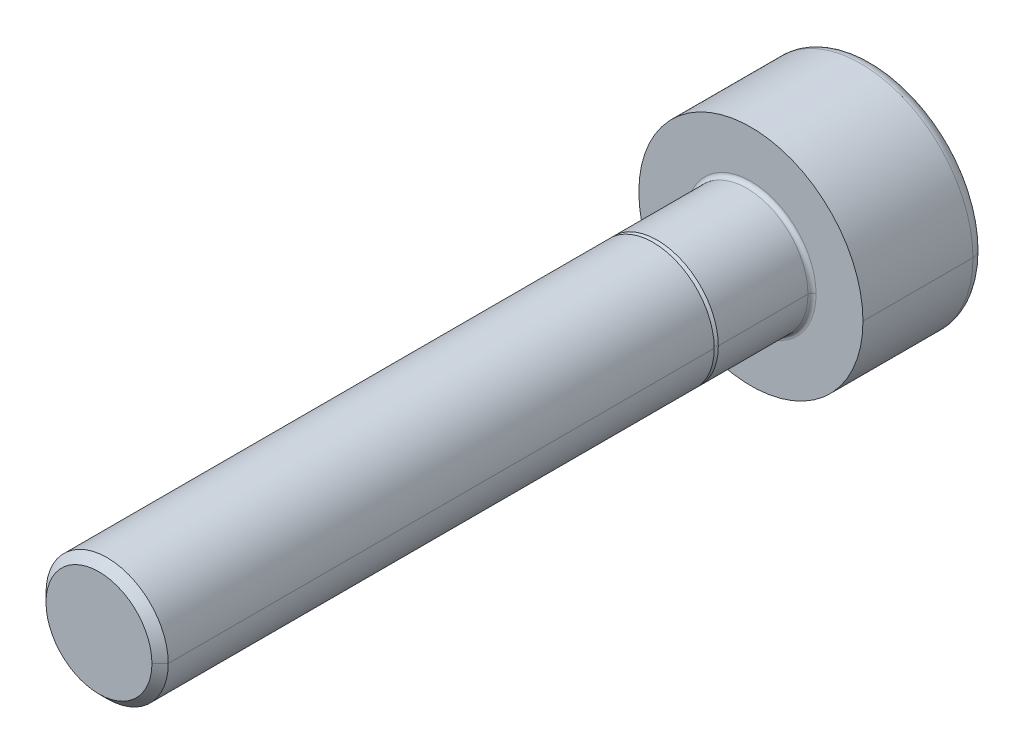
ISO-10303-21;
HEADER;
FILE_DESCRIPTION(('STEP AP214'),'2;1');
FILE_NAME('part.step','',(''),(''),'','','');
FILE_SCHEMA(('AUTOMOTIVE_DESIGN { 1 0 10303 214 1 1 1 1 }'));
ENDSEC;
DATA;
#1=APPLICATION_CONTEXT('core data for automotive mechanical design processes');
#2=APPLICATION_PROTOCOL_DEFINITION('international standard','automotive_design',2000,#1);
#3=PRODUCT_CONTEXT('',#1,'mechanical');
#4=PRODUCT('Part','Part','',(#3));
#5=PRODUCT_RELATED_PRODUCT_CATEGORY('part','',(#4));
#6=PRODUCT_DEFINITION_FORMATION('','',#4);
#7=PRODUCT_DEFINITION_CONTEXT('part definition',#1,'design');
#8=PRODUCT_DEFINITION('design','',#6,#7);
#9=PRODUCT_DEFINITION_SHAPE('','',#8);
#10=(LENGTH_UNIT() NAMED_UNIT(*) SI_UNIT(.MILLI.,.METRE.));
#11=(NAMED_UNIT(*) PLANE_ANGLE_UNIT() SI_UNIT($,.RADIAN.));
#12=(NAMED_UNIT(*) SI_UNIT($,.STERADIAN.) SOLID_ANGLE_UNIT());
#13=UNCERTAINTY_MEASURE_WITH_UNIT(LENGTH_MEASURE(1.E-05),#10,'distance_accuracy_value','');
#14=(GEOMETRIC_REPRESENTATION_CONTEXT(3) GLOBAL_UNCERTAINTY_ASSIGNED_CONTEXT((#13)) GLOBAL_UNIT_ASSIGNED_CONTEXT((#10,
#11,#12)) REPRESENTATION_CONTEXT('',''));
#15=CARTESIAN_POINT('',(0.,0.,0.));
#16=DIRECTION('',(0.,0.,1.));
#17=DIRECTION('',(1.,0.,0.));
#18=AXIS2_PLACEMENT_3D('',#15,#16,#17);
#19=CARTESIAN_POINT('',(0.,0.,-2.7));
#20=DIRECTION('',(0.,0.,1.));
#21=DIRECTION('',(1.,0.,0.));
#22=AXIS2_PLACEMENT_3D('',#19,#20,#21);
#23=TOROIDAL_SURFACE('',#22,2.45,0.3);
#24=CARTESIAN_POINT('',(-2.45,0.,-2.7));
#25=DIRECTION('',(0.,1.,0.));
#26=DIRECTION('',(-1.,0.,0.));
#27=AXIS2_PLACEMENT_3D('',#24,#25,#26);
#28=CIRCLE('',#27,0.3);
#29=CARTESIAN_POINT('',(-2.45,0.,-3.));
#30=VERTEX_POINT('',#29);
#31=CARTESIAN_POINT('',(-2.75,0.,-2.7));
#32=VERTEX_POINT('',#31);
#33=EDGE_CURVE('E331',#30,#32,#28,.T.);
#34=ORIENTED_EDGE('',*,*,#33,.F.);
#35=CARTESIAN_POINT('',(0.,0.,-3.));
#36=DIRECTION('',(0.,0.,-1.));
#37=DIRECTION('',(1.,0.,0.));
#38=AXIS2_PLACEMENT_3D('',#35,#36,#37);
#39=CIRCLE('',#38,2.45);
#40=CARTESIAN_POINT('',(2.45,0.,-3.));
#41=VERTEX_POINT('',#40);
#42=EDGE_CURVE('E216',#41,#30,#39,.T.);
#43=ORIENTED_EDGE('',*,*,#42,.F.);
#44=CARTESIAN_POINT('',(2.45,0.,-2.7));
#45=DIRECTION('',(0.,-1.,0.));
#46=DIRECTION('',(0.,0.,-1.));
#47=AXIS2_PLACEMENT_3D('',#44,#45,#46);
#48=CIRCLE('',#47,0.3);
#49=CARTESIAN_POINT('',(2.75,0.,-2.7));
#50=VERTEX_POINT('',#49);
#51=EDGE_CURVE('E339',#41,#50,#48,.T.);
#52=ORIENTED_EDGE('',*,*,#51,.T.);
#53=CARTESIAN_POINT('',(0.,0.,-2.7));
#54=DIRECTION('',(0.,0.,1.));
#55=DIRECTION('',(1.,0.,0.));
#56=AXIS2_PLACEMENT_3D('',#53,#54,#55);
#57=CIRCLE('',#56,2.75);
#58=EDGE_CURVE('E211',#32,#50,#57,.T.);
#59=ORIENTED_EDGE('',*,*,#58,.F.);
#60=EDGE_LOOP('',(#34,#43,#52,#59));
#61=FACE_BOUND('',#60,.T.);
#62=ADVANCED_FACE('F17',(#61),#23,.T.);
#63=CARTESIAN_POINT('',(0.,0.,0.1));
#64=DIRECTION('',(0.,0.,1.));
#65=DIRECTION('',(1.,0.,0.));
#66=AXIS2_PLACEMENT_3D('',#63,#64,#65);
#67=TOROIDAL_SURFACE('',#66,1.6,0.1);
#68=CARTESIAN_POINT('',(-1.6,0.,0.1));
#69=DIRECTION('',(0.,1.,0.));
#70=DIRECTION('',(-1.,0.,0.));
#71=AXIS2_PLACEMENT_3D('',#68,#69,#70);
#72=CIRCLE('',#71,0.1);
#73=CARTESIAN_POINT('',(-1.5,0.,0.1));
#74=VERTEX_POINT('',#73);
#75=CARTESIAN_POINT('',(-1.6,0.,0.));
#76=VERTEX_POINT('',#75);
#77=EDGE_CURVE('E362',#74,#76,#72,.T.);
#78=ORIENTED_EDGE('',*,*,#77,.F.);
#79=CARTESIAN_POINT('',(0.,0.,0.1));
#80=DIRECTION('',(0.,0.,1.));
#81=DIRECTION('',(1.,0.,0.));
#82=AXIS2_PLACEMENT_3D('',#79,#80,#81);
#83=CIRCLE('',#82,1.5);
#84=CARTESIAN_POINT('',(1.5,0.,0.1));
#85=VERTEX_POINT('',#84);
#86=EDGE_CURVE('E176',#85,#74,#83,.T.);
#87=ORIENTED_EDGE('',*,*,#86,.F.);
#88=CARTESIAN_POINT('',(1.6,0.,0.1));
#89=DIRECTION('',(0.,-1.,0.));
#90=DIRECTION('',(0.,0.,-1.));
#91=AXIS2_PLACEMENT_3D('',#88,#89,#90);
#92=CIRCLE('',#91,0.1);
#93=CARTESIAN_POINT('',(1.6,0.,0.));
#94=VERTEX_POINT('',#93);
#95=EDGE_CURVE('E367',#85,#94,#92,.T.);
#96=ORIENTED_EDGE('',*,*,#95,.T.);
#97=CARTESIAN_POINT('',(0.,0.,0.));
#98=DIRECTION('',(0.,0.,-1.));
#99=DIRECTION('',(1.,0.,0.));
#100=AXIS2_PLACEMENT_3D('',#97,#98,#99);
#101=CIRCLE('',#100,1.6);
#102=EDGE_CURVE('E202',#76,#94,#101,.T.);
#103=ORIENTED_EDGE('',*,*,#102,.F.);
#104=EDGE_LOOP('',(#78,#87,#96,#103));
#105=FACE_BOUND('',#104,.T.);
#106=ADVANCED_FACE('F519',(#105),#67,.F.);
#107=CARTESIAN_POINT('',(0.,0.,16.));
#108=DIRECTION('',(0.,0.,-1.));
#109=DIRECTION('',(-1.,0.,0.));
#110=AXIS2_PLACEMENT_3D('',#107,#108,#109);
#111=CONICAL_SURFACE('',#110,1.3,0.785398163397442);
#112=DIRECTION('',(0.707106781186543,0.,-0.707106781186553));
#113=VECTOR('',#112,1.);
#114=CARTESIAN_POINT('',(1.3,0.,16.));
#115=LINE('',#114,#113);
#116=CARTESIAN_POINT('',(1.3,0.,16.));
#117=VERTEX_POINT('',#116);
#118=CARTESIAN_POINT('',(1.5,0.,15.8));
#119=VERTEX_POINT('',#118);
#120=EDGE_CURVE('E156',#117,#119,#115,.T.);
#121=ORIENTED_EDGE('',*,*,#120,.F.);
#122=CARTESIAN_POINT('',(0.,0.,16.));
#123=DIRECTION('',(0.,0.,1.));
#124=DIRECTION('',(1.,0.,0.));
#125=AXIS2_PLACEMENT_3D('',#122,#123,#124);
#126=CIRCLE('',#125,1.3);
#127=CARTESIAN_POINT('',(-1.3,0.,16.));
#128=VERTEX_POINT('',#127);
#129=EDGE_CURVE('E11',#128,#117,#126,.T.);
#130=ORIENTED_EDGE('',*,*,#129,.F.);
#131=DIRECTION('',(-0.707106781186543,0.,-0.707106781186553));
#132=VECTOR('',#131,1.);
#133=CARTESIAN_POINT('',(-1.3,0.,16.));
#134=LINE('',#133,#132);
#135=CARTESIAN_POINT('',(-1.5,0.,15.8));
#136=VERTEX_POINT('',#135);
#137=EDGE_CURVE('E155',#128,#136,#134,.T.);
#138=ORIENTED_EDGE('',*,*,#137,.T.);
#139=CARTESIAN_POINT('',(0.,0.,15.8));
#140=DIRECTION('',(0.,0.,-1.));
#141=DIRECTION('',(1.,0.,0.));
#142=AXIS2_PLACEMENT_3D('',#139,#140,#141);
#143=CIRCLE('',#142,1.5);
#144=EDGE_CURVE('E167',#119,#136,#143,.T.);
#145=ORIENTED_EDGE('',*,*,#144,.F.);
#146=EDGE_LOOP('',(#121,#130,#138,#145));
#147=FACE_BOUND('',#146,.T.);
#148=ADVANCED_FACE('F396',(#147),#111,.T.);
#149=CARTESIAN_POINT('',(0.,0.,2.4));
#150=DIRECTION('',(0.,0.,1.));
#151=DIRECTION('',(1.,0.,0.));
#152=AXIS2_PLACEMENT_3D('',#149,#150,#151);
#153=PLANE('',#152);
#154=CARTESIAN_POINT('',(0.,0.,2.4));
#155=DIRECTION('',(0.,0.,1.));
#156=DIRECTION('',(1.,0.,0.));
#157=AXIS2_PLACEMENT_3D('',#154,#155,#156);
#158=CIRCLE('',#157,1.4);
#159=CARTESIAN_POINT('',(-1.4,0.,2.4));
#160=VERTEX_POINT('',#159);
#161=CARTESIAN_POINT('',(1.4,0.,2.4));
#162=VERTEX_POINT('',#161);
#163=EDGE_CURVE('E170',#160,#162,#158,.T.);
#164=ORIENTED_EDGE('',*,*,#163,.T.);
#165=CARTESIAN_POINT('',(0.,0.,2.4));
#166=DIRECTION('',(0.,0.,1.));
#167=DIRECTION('',(1.,0.,0.));
#168=AXIS2_PLACEMENT_3D('',#165,#166,#167);
#169=CIRCLE('',#168,1.4);
#170=EDGE_CURVE('E157',#162,#160,#169,.T.);
#171=ORIENTED_EDGE('',*,*,#170,.T.);
#172=EDGE_LOOP('',(#164,#171));
#173=FACE_BOUND('',#172,.T.);
#174=CARTESIAN_POINT('',(0.,0.,2.4));
#175=DIRECTION('',(0.,0.,1.));
#176=DIRECTION('',(1.,0.,0.));
#177=AXIS2_PLACEMENT_3D('',#174,#175,#176);
#178=CIRCLE('',#177,1.5);
#179=CARTESIAN_POINT('',(-1.5,0.,2.4));
#180=VERTEX_POINT('',#179);
#181=CARTESIAN_POINT('',(1.5,0.,2.4));
#182=VERTEX_POINT('',#181);
#183=EDGE_CURVE('E20',#180,#182,#178,.T.);
#184=ORIENTED_EDGE('',*,*,#183,.F.);
#185=CARTESIAN_POINT('',(0.,0.,2.4));
#186=DIRECTION('',(0.,0.,1.));
#187=DIRECTION('',(1.,0.,0.));
#188=AXIS2_PLACEMENT_3D('',#185,#186,#187);
#189=CIRCLE('',#188,1.5);
#190=EDGE_CURVE('E166',#182,#180,#189,.T.);
#191=ORIENTED_EDGE('',*,*,#190,.F.);
#192=EDGE_LOOP('',(#184,#191));
#193=FACE_BOUND('',#192,.T.);
#194=ADVANCED_FACE('F264',(#173,#193),#153,.F.);
#195=CARTESIAN_POINT('',(0.,0.,16.));
#196=DIRECTION('',(0.,0.,1.));
#197=DIRECTION('',(1.,0.,0.));
#198=AXIS2_PLACEMENT_3D('',#195,#196,#197);
#199=PLANE('',#198);
#200=ORIENTED_EDGE('',*,*,#129,.T.);
#201=CARTESIAN_POINT('',(0.,0.,16.));
#202=DIRECTION('',(0.,0.,1.));
#203=DIRECTION('',(1.,0.,0.));
#204=AXIS2_PLACEMENT_3D('',#201,#202,#203);
#205=CIRCLE('',#204,1.3);
#206=EDGE_CURVE('E353',#117,#128,#205,.T.);
#207=ORIENTED_EDGE('',*,*,#206,.T.);
#208=EDGE_LOOP('',(#200,#207));
#209=FACE_BOUND('',#208,.T.);
#210=ADVANCED_FACE('F389',(#209),#199,.T.);
#211=CARTESIAN_POINT('',(0.,0.,16.));
#212=DIRECTION('',(0.,0.,-1.));
#213=DIRECTION('',(-1.,0.,0.));
#214=AXIS2_PLACEMENT_3D('',#211,#212,#213);
#215=CYLINDRICAL_SURFACE('',#214,1.5);
#216=DIRECTION('',(0.,0.,-1.));
#217=VECTOR('',#216,1.);
#218=CARTESIAN_POINT('',(1.5,0.,16.));
#219=LINE('',#218,#217);
#220=EDGE_CURVE('E150',#119,#182,#219,.T.);
#221=ORIENTED_EDGE('',*,*,#220,.F.);
#222=ORIENTED_EDGE('',*,*,#144,.T.);
#223=DIRECTION('',(0.,0.,-1.));
#224=VECTOR('',#223,1.);
#225=CARTESIAN_POINT('',(-1.5,0.,16.));
#226=LINE('',#225,#224);
#227=EDGE_CURVE('E162',#136,#180,#226,.T.);
#228=ORIENTED_EDGE('',*,*,#227,.T.);
#229=ORIENTED_EDGE('',*,*,#183,.T.);
#230=EDGE_LOOP('',(#221,#222,#228,#229));
#231=FACE_BOUND('',#230,.T.);
#232=ADVANCED_FACE('F401',(#231),#215,.T.);
#233=CARTESIAN_POINT('',(0.,0.,2.4));
#234=DIRECTION('',(0.,0.,-1.));
#235=DIRECTION('',(-1.,0.,0.));
#236=AXIS2_PLACEMENT_3D('',#233,#234,#235);
#237=CONICAL_SURFACE('',#236,1.4,0.785398163397446);
#238=DIRECTION('',(0.707106781186546,0.,-0.707106781186549));
#239=VECTOR('',#238,1.);
#240=CARTESIAN_POINT('',(1.4,0.,2.4));
#241=LINE('',#240,#239);
#242=CARTESIAN_POINT('',(1.5,0.,2.3));
#243=VERTEX_POINT('',#242);
#244=EDGE_CURVE('E161',#162,#243,#241,.T.);
#245=ORIENTED_EDGE('',*,*,#244,.F.);
#246=ORIENTED_EDGE('',*,*,#163,.F.);
#247=DIRECTION('',(-0.707106781186546,0.,-0.707106781186549));
#248=VECTOR('',#247,1.);
#249=CARTESIAN_POINT('',(-1.4,0.,2.4));
#250=LINE('',#249,#248);
#251=CARTESIAN_POINT('',(-1.5,0.,2.3));
#252=VERTEX_POINT('',#251);
#253=EDGE_CURVE('E187',#160,#252,#250,.T.);
#254=ORIENTED_EDGE('',*,*,#253,.T.);
#255=CARTESIAN_POINT('',(0.,0.,2.3));
#256=DIRECTION('',(0.,0.,-1.));
#257=DIRECTION('',(1.,0.,0.));
#258=AXIS2_PLACEMENT_3D('',#255,#256,#257);
#259=CIRCLE('',#258,1.5);
#260=EDGE_CURVE('E253',#243,#252,#259,.T.);
#261=ORIENTED_EDGE('',*,*,#260,.F.);
#262=EDGE_LOOP('',(#245,#246,#254,#261));
#263=FACE_BOUND('',#262,.T.);
#264=ADVANCED_FACE('F269',(#263),#237,.T.);
#265=CARTESIAN_POINT('',(0.,0.,2.4));
#266=DIRECTION('',(0.,0.,-1.));
#267=DIRECTION('',(-1.,0.,0.));
#268=AXIS2_PLACEMENT_3D('',#265,#266,#267);
#269=CYLINDRICAL_SURFACE('',#268,1.5);
#270=DIRECTION('',(0.,0.,-1.));
#271=VECTOR('',#270,1.);
#272=CARTESIAN_POINT('',(1.5,0.,2.4));
#273=LINE('',#272,#271);
#274=EDGE_CURVE('E191',#243,#85,#273,.T.);
#275=ORIENTED_EDGE('',*,*,#274,.F.);
#276=ORIENTED_EDGE('',*,*,#260,.T.);
#277=DIRECTION('',(0.,0.,-1.));
#278=VECTOR('',#277,1.);
#279=CARTESIAN_POINT('',(-1.5,0.,2.4));
#280=LINE('',#279,#278);
#281=EDGE_CURVE('E171',#252,#74,#280,.T.);
#282=ORIENTED_EDGE('',*,*,#281,.T.);
#283=CARTESIAN_POINT('',(0.,0.,0.1));
#284=DIRECTION('',(0.,0.,1.));
#285=DIRECTION('',(1.,0.,0.));
#286=AXIS2_PLACEMENT_3D('',#283,#284,#285);
#287=CIRCLE('',#286,1.5);
#288=EDGE_CURVE('E358',#74,#85,#287,.T.);
#289=ORIENTED_EDGE('',*,*,#288,.T.);
#290=EDGE_LOOP('',(#275,#276,#282,#289));
#291=FACE_BOUND('',#290,.T.);
#292=ADVANCED_FACE('F612',(#291),#269,.T.);
#293=CARTESIAN_POINT('',(0.,0.,-1.7));
#294=DIRECTION('',(0.,0.,-1.));
#295=DIRECTION('',(0.,-1.,0.));
#296=AXIS2_PLACEMENT_3D('',#293,#294,#295);
#297=PLANE('',#296);
#298=DIRECTION('',(-0.5,-0.866025403784438,0.));
#299=VECTOR('',#298,1.);
#300=CARTESIAN_POINT('',(1.44337567297406,0.,-1.7));
#301=LINE('',#300,#299);
#302=CARTESIAN_POINT('',(1.44337567297406,0.,-1.7));
#303=VERTEX_POINT('',#302);
#304=CARTESIAN_POINT('',(0.721687836487032,-1.25,-1.7));
#305=VERTEX_POINT('',#304);
#306=EDGE_CURVE('E201',#303,#305,#301,.T.);
#307=ORIENTED_EDGE('',*,*,#306,.T.);
#308=DIRECTION('',(-1.,0.,0.));
#309=VECTOR('',#308,1.);
#310=CARTESIAN_POINT('',(0.721687836487032,-1.25,-1.7));
#311=LINE('',#310,#309);
#312=CARTESIAN_POINT('',(-0.721687836487033,-1.25,-1.7));
#313=VERTEX_POINT('',#312);
#314=EDGE_CURVE('E40',#305,#313,#311,.T.);
#315=ORIENTED_EDGE('',*,*,#314,.T.);
#316=DIRECTION('',(-0.5,0.866025403784439,0.));
#317=VECTOR('',#316,1.);
#318=CARTESIAN_POINT('',(-0.721687836487033,-1.25,-1.7));
#319=LINE('',#318,#317);
#320=CARTESIAN_POINT('',(-1.44337567297406,0.,-1.7));
#321=VERTEX_POINT('',#320);
#322=EDGE_CURVE('E120',#313,#321,#319,.T.);
#323=ORIENTED_EDGE('',*,*,#322,.T.);
#324=DIRECTION('',(0.5,0.866025403784438,0.));
#325=VECTOR('',#324,1.);
#326=CARTESIAN_POINT('',(-1.44337567297406,0.,-1.7));
#327=LINE('',#326,#325);
#328=CARTESIAN_POINT('',(-0.721687836487032,1.25,-1.7));
#329=VERTEX_POINT('',#328);
#330=EDGE_CURVE('E113',#321,#329,#327,.T.);
#331=ORIENTED_EDGE('',*,*,#330,.T.);
#332=DIRECTION('',(1.,0.,0.));
#333=VECTOR('',#332,1.);
#334=CARTESIAN_POINT('',(-0.721687836487032,1.25,-1.7));
#335=LINE('',#334,#333);
#336=CARTESIAN_POINT('',(0.721687836487033,1.25,-1.7));
#337=VERTEX_POINT('',#336);
#338=EDGE_CURVE('E117',#329,#337,#335,.T.);
#339=ORIENTED_EDGE('',*,*,#338,.T.);
#340=DIRECTION('',(0.5,-0.866025403784439,0.));
#341=VECTOR('',#340,1.);
#342=CARTESIAN_POINT('',(0.721687836487033,1.25,-1.7));
#343=LINE('',#342,#341);
#344=EDGE_CURVE('E146',#337,#303,#343,.T.);
#345=ORIENTED_EDGE('',*,*,#344,.T.);
#346=EDGE_LOOP('',(#307,#315,#323,#331,#339,#345));
#347=FACE_BOUND('',#346,.T.);
#348=ADVANCED_FACE('F115',(#347),#297,.T.);
#349=CARTESIAN_POINT('',(0.721687836487032,-1.25,-1.7));
#350=DIRECTION('',(0.,-1.,0.));
#351=DIRECTION('',(-1.,0.,0.));
#352=AXIS2_PLACEMENT_3D('',#349,#350,#351);
#353=PLANE('',#352);
#354=DIRECTION('',(-1.,0.,0.));
#355=VECTOR('',#354,1.);
#356=CARTESIAN_POINT('',(0.721687836487032,-1.25,-3.));
#357=LINE('',#356,#355);
#358=CARTESIAN_POINT('',(0.721687836487032,-1.25,-3.));
#359=VERTEX_POINT('',#358);
#360=CARTESIAN_POINT('',(-0.721687836487033,-1.25,-3.));
#361=VERTEX_POINT('',#360);
#362=EDGE_CURVE('E219',#359,#361,#357,.T.);
#363=ORIENTED_EDGE('',*,*,#362,.T.);
#364=DIRECTION('',(0.,0.,-1.));
#365=VECTOR('',#364,1.);
#366=CARTESIAN_POINT('',(-0.721687836487033,-1.25,-1.7));
#367=LINE('',#366,#365);
#368=EDGE_CURVE('E249',#313,#361,#367,.T.);
#369=ORIENTED_EDGE('',*,*,#368,.F.);
#370=ORIENTED_EDGE('',*,*,#314,.F.);
#371=DIRECTION('',(0.,0.,-1.));
#372=VECTOR('',#371,1.);
#373=CARTESIAN_POINT('',(0.721687836487032,-1.25,-1.7));
#374=LINE('',#373,#372);
#375=EDGE_CURVE('E198',#305,#359,#374,.T.);
#376=ORIENTED_EDGE('',*,*,#375,.T.);
#377=EDGE_LOOP('',(#363,#369,#370,#376));
#378=FACE_BOUND('',#377,.T.);
#379=ADVANCED_FACE('F563',(#378),#353,.F.);
#380=CARTESIAN_POINT('',(-0.721687836487033,-1.25,-1.7));
#381=DIRECTION('',(-0.866025403784439,-0.5,0.));
#382=DIRECTION('',(-0.5,0.866025403784439,0.));
#383=AXIS2_PLACEMENT_3D('',#380,#381,#382);
#384=PLANE('',#383);
#385=DIRECTION('',(-0.5,0.866025403784439,0.));
#386=VECTOR('',#385,1.);
#387=CARTESIAN_POINT('',(-0.721687836487033,-1.25,-3.));
#388=LINE('',#387,#386);
#389=CARTESIAN_POINT('',(-1.44337567297406,0.,-3.));
#390=VERTEX_POINT('',#389);
#391=EDGE_CURVE('E234',#361,#390,#388,.T.);
#392=ORIENTED_EDGE('',*,*,#391,.T.);
#393=DIRECTION('',(0.,0.,-1.));
#394=VECTOR('',#393,1.);
#395=CARTESIAN_POINT('',(-1.44337567297406,0.,-1.7));
#396=LINE('',#395,#394);
#397=EDGE_CURVE('E124',#321,#390,#396,.T.);
#398=ORIENTED_EDGE('',*,*,#397,.F.);
#399=ORIENTED_EDGE('',*,*,#322,.F.);
#400=ORIENTED_EDGE('',*,*,#368,.T.);
#401=EDGE_LOOP('',(#392,#398,#399,#400));
#402=FACE_BOUND('',#401,.T.);
#403=ADVANCED_FACE('F477',(#402),#384,.F.);
#404=CARTESIAN_POINT('',(-1.44337567297406,0.,-1.7));
#405=DIRECTION('',(-0.866025403784438,0.5,0.));
#406=DIRECTION('',(0.,0.,1.));
#407=AXIS2_PLACEMENT_3D('',#404,#405,#406);
#408=PLANE('',#407);
#409=DIRECTION('',(0.5,0.866025403784438,0.));
#410=VECTOR('',#409,1.);
#411=CARTESIAN_POINT('',(-1.44337567297406,0.,-3.));
#412=LINE('',#411,#410);
#413=CARTESIAN_POINT('',(-0.721687836487032,1.25,-3.));
#414=VERTEX_POINT('',#413);
#415=EDGE_CURVE('E130',#390,#414,#412,.T.);
#416=ORIENTED_EDGE('',*,*,#415,.T.);
#417=DIRECTION('',(0.,0.,-1.));
#418=VECTOR('',#417,1.);
#419=CARTESIAN_POINT('',(-0.721687836487032,1.25,-1.7));
#420=LINE('',#419,#418);
#421=EDGE_CURVE('E125',#329,#414,#420,.T.);
#422=ORIENTED_EDGE('',*,*,#421,.F.);
#423=ORIENTED_EDGE('',*,*,#330,.F.);
#424=ORIENTED_EDGE('',*,*,#397,.T.);
#425=EDGE_LOOP('',(#416,#422,#423,#424));
#426=FACE_BOUND('',#425,.T.);
#427=ADVANCED_FACE('F128',(#426),#408,.F.);
#428=CARTESIAN_POINT('',(-0.721687836487032,1.25,-1.7));
#429=DIRECTION('',(0.,1.,0.));
#430=DIRECTION('',(1.,0.,0.));
#431=AXIS2_PLACEMENT_3D('',#428,#429,#430);
#432=PLANE('',#431);
#433=DIRECTION('',(1.,0.,0.));
#434=VECTOR('',#433,1.);
#435=CARTESIAN_POINT('',(-0.721687836487032,1.25,-3.));
#436=LINE('',#435,#434);
#437=CARTESIAN_POINT('',(0.721687836487033,1.25,-3.));
#438=VERTEX_POINT('',#437);
#439=EDGE_CURVE('E229',#414,#438,#436,.T.);
#440=ORIENTED_EDGE('',*,*,#439,.T.);
#441=DIRECTION('',(0.,0.,-1.));
#442=VECTOR('',#441,1.);
#443=CARTESIAN_POINT('',(0.721687836487033,1.25,-1.7));
#444=LINE('',#443,#442);
#445=EDGE_CURVE('E137',#337,#438,#444,.T.);
#446=ORIENTED_EDGE('',*,*,#445,.F.);
#447=ORIENTED_EDGE('',*,*,#338,.F.);
#448=ORIENTED_EDGE('',*,*,#421,.T.);
#449=EDGE_LOOP('',(#440,#446,#447,#448));
#450=FACE_BOUND('',#449,.T.);
#451=ADVANCED_FACE('F136',(#450),#432,.F.);
#452=CARTESIAN_POINT('',(0.721687836487033,1.25,-1.7));
#453=DIRECTION('',(0.866025403784439,0.5,0.));
#454=DIRECTION('',(0.,0.,-1.));
#455=AXIS2_PLACEMENT_3D('',#452,#453,#454);
#456=PLANE('',#455);
#457=DIRECTION('',(0.5,-0.866025403784439,0.));
#458=VECTOR('',#457,1.);
#459=CARTESIAN_POINT('',(0.721687836487033,1.25,-3.));
#460=LINE('',#459,#458);
#461=CARTESIAN_POINT('',(1.44337567297406,0.,-3.));
#462=VERTEX_POINT('',#461);
#463=EDGE_CURVE('E225',#438,#462,#460,.T.);
#464=ORIENTED_EDGE('',*,*,#463,.T.);
#465=DIRECTION('',(0.,0.,-1.));
#466=VECTOR('',#465,1.);
#467=CARTESIAN_POINT('',(1.44337567297406,0.,-1.7));
#468=LINE('',#467,#466);
#469=EDGE_CURVE('E197',#303,#462,#468,.T.);
#470=ORIENTED_EDGE('',*,*,#469,.F.);
#471=ORIENTED_EDGE('',*,*,#344,.F.);
#472=ORIENTED_EDGE('',*,*,#445,.T.);
#473=EDGE_LOOP('',(#464,#470,#471,#472));
#474=FACE_BOUND('',#473,.T.);
#475=ADVANCED_FACE('F413',(#474),#456,.F.);
#476=CARTESIAN_POINT('',(1.44337567297406,0.,-1.7));
#477=DIRECTION('',(0.866025403784439,-0.5,0.));
#478=DIRECTION('',(0.,0.,-1.));
#479=AXIS2_PLACEMENT_3D('',#476,#477,#478);
#480=PLANE('',#479);
#481=DIRECTION('',(-0.5,-0.866025403784438,0.));
#482=VECTOR('',#481,1.);
#483=CARTESIAN_POINT('',(1.44337567297406,0.,-3.));
#484=LINE('',#483,#482);
#485=EDGE_CURVE('E224',#462,#359,#484,.T.);
#486=ORIENTED_EDGE('',*,*,#485,.T.);
#487=ORIENTED_EDGE('',*,*,#375,.F.);
#488=ORIENTED_EDGE('',*,*,#306,.F.);
#489=ORIENTED_EDGE('',*,*,#469,.T.);
#490=EDGE_LOOP('',(#486,#487,#488,#489));
#491=FACE_BOUND('',#490,.T.);
#492=ADVANCED_FACE('F418',(#491),#480,.F.);
#493=CARTESIAN_POINT('',(0.,0.,0.));
#494=DIRECTION('',(0.,0.,1.));
#495=DIRECTION('',(1.,0.,0.));
#496=AXIS2_PLACEMENT_3D('',#493,#494,#495);
#497=PLANE('',#496);
#498=CARTESIAN_POINT('',(0.,0.,0.));
#499=DIRECTION('',(0.,0.,-1.));
#500=DIRECTION('',(1.,0.,0.));
#501=AXIS2_PLACEMENT_3D('',#498,#499,#500);
#502=CIRCLE('',#501,1.6);
#503=EDGE_CURVE('E371',#94,#76,#502,.T.);
#504=ORIENTED_EDGE('',*,*,#503,.T.);
#505=ORIENTED_EDGE('',*,*,#102,.T.);
#506=EDGE_LOOP('',(#504,#505));
#507=FACE_BOUND('',#506,.T.);
#508=CARTESIAN_POINT('',(0.,0.,0.));
#509=DIRECTION('',(0.,0.,1.));
#510=DIRECTION('',(1.,0.,0.));
#511=AXIS2_PLACEMENT_3D('',#508,#509,#510);
#512=CIRCLE('',#511,2.75);
#513=CARTESIAN_POINT('',(2.75,0.,0.));
#514=VERTEX_POINT('',#513);
#515=CARTESIAN_POINT('',(-2.75,0.,0.));
#516=VERTEX_POINT('',#515);
#517=EDGE_CURVE('E206',#514,#516,#512,.T.);
#518=ORIENTED_EDGE('',*,*,#517,.T.);
#519=CARTESIAN_POINT('',(0.,0.,0.));
#520=DIRECTION('',(0.,0.,1.));
#521=DIRECTION('',(1.,0.,0.));
#522=AXIS2_PLACEMENT_3D('',#519,#520,#521);
#523=CIRCLE('',#522,2.75);
#524=EDGE_CURVE('E215',#516,#514,#523,.T.);
#525=ORIENTED_EDGE('',*,*,#524,.T.);
#526=EDGE_LOOP('',(#518,#525));
#527=FACE_BOUND('',#526,.T.);
#528=ADVANCED_FACE('F442',(#507,#527),#497,.T.);
#529=CARTESIAN_POINT('',(0.,0.,-3.));
#530=DIRECTION('',(0.,0.,1.));
#531=DIRECTION('',(1.,0.,0.));
#532=AXIS2_PLACEMENT_3D('',#529,#530,#531);
#533=PLANE('',#532);
#534=ORIENTED_EDGE('',*,*,#362,.F.);
#535=ORIENTED_EDGE('',*,*,#485,.F.);
#536=ORIENTED_EDGE('',*,*,#463,.F.);
#537=ORIENTED_EDGE('',*,*,#439,.F.);
#538=ORIENTED_EDGE('',*,*,#415,.F.);
#539=ORIENTED_EDGE('',*,*,#391,.F.);
#540=EDGE_LOOP('',(#534,#535,#536,#537,#538,#539));
#541=FACE_BOUND('',#540,.T.);
#542=ORIENTED_EDGE('',*,*,#42,.T.);
#543=CARTESIAN_POINT('',(0.,0.,-3.));
#544=DIRECTION('',(0.,0.,-1.));
#545=DIRECTION('',(1.,0.,0.));
#546=AXIS2_PLACEMENT_3D('',#543,#544,#545);
#547=CIRCLE('',#546,2.45);
#548=EDGE_CURVE('E326',#30,#41,#547,.T.);
#549=ORIENTED_EDGE('',*,*,#548,.T.);
#550=EDGE_LOOP('',(#542,#549));
#551=FACE_BOUND('',#550,.T.);
#552=ADVANCED_FACE('F324',(#541,#551),#533,.F.);
#553=CARTESIAN_POINT('',(0.,0.,-3.));
#554=DIRECTION('',(0.,0.,1.));
#555=DIRECTION('',(1.,0.,0.));
#556=AXIS2_PLACEMENT_3D('',#553,#554,#555);
#557=CYLINDRICAL_SURFACE('',#556,2.75);
#558=DIRECTION('',(0.,0.,1.));
#559=VECTOR('',#558,1.);
#560=CARTESIAN_POINT('',(-2.75,0.,-3.));
#561=LINE('',#560,#559);
#562=EDGE_CURVE('E175',#32,#516,#561,.T.);
#563=ORIENTED_EDGE('',*,*,#562,.F.);
#564=ORIENTED_EDGE('',*,*,#58,.T.);
#565=DIRECTION('',(0.,0.,1.));
#566=VECTOR('',#565,1.);
#567=CARTESIAN_POINT('',(2.75,0.,-3.));
#568=LINE('',#567,#566);
#569=EDGE_CURVE('E210',#50,#514,#568,.T.);
#570=ORIENTED_EDGE('',*,*,#569,.T.);
#571=ORIENTED_EDGE('',*,*,#524,.F.);
#572=EDGE_LOOP('',(#563,#564,#570,#571));
#573=FACE_BOUND('',#572,.T.);
#574=ADVANCED_FACE('F484',(#573),#557,.T.);
#575=CARTESIAN_POINT('',(0.,0.,-3.));
#576=DIRECTION('',(0.,0.,1.));
#577=DIRECTION('',(1.,0.,0.));
#578=AXIS2_PLACEMENT_3D('',#575,#576,#577);
#579=CYLINDRICAL_SURFACE('',#578,2.75);
#580=CARTESIAN_POINT('',(0.,0.,-2.7));
#581=DIRECTION('',(0.,0.,1.));
#582=DIRECTION('',(1.,0.,0.));
#583=AXIS2_PLACEMENT_3D('',#580,#581,#582);
#584=CIRCLE('',#583,2.75);
#585=EDGE_CURVE('E336',#50,#32,#584,.T.);
#586=ORIENTED_EDGE('',*,*,#585,.T.);
#587=ORIENTED_EDGE('',*,*,#562,.T.);
#588=ORIENTED_EDGE('',*,*,#517,.F.);
#589=ORIENTED_EDGE('',*,*,#569,.F.);
#590=EDGE_LOOP('',(#586,#587,#588,#589));
#591=FACE_BOUND('',#590,.T.);
#592=ADVANCED_FACE('F489',(#591),#579,.T.);
#593=CARTESIAN_POINT('',(0.,0.,2.4));
#594=DIRECTION('',(0.,0.,-1.));
#595=DIRECTION('',(-1.,0.,0.));
#596=AXIS2_PLACEMENT_3D('',#593,#594,#595);
#597=CYLINDRICAL_SURFACE('',#596,1.5);
#598=CARTESIAN_POINT('',(0.,0.,2.3));
#599=DIRECTION('',(0.,0.,-1.));
#600=DIRECTION('',(1.,0.,0.));
#601=AXIS2_PLACEMENT_3D('',#598,#599,#600);
#602=CIRCLE('',#601,1.5);
#603=EDGE_CURVE('E183',#252,#243,#602,.T.);
#604=ORIENTED_EDGE('',*,*,#603,.T.);
#605=ORIENTED_EDGE('',*,*,#274,.T.);
#606=ORIENTED_EDGE('',*,*,#86,.T.);
#607=ORIENTED_EDGE('',*,*,#281,.F.);
#608=EDGE_LOOP('',(#604,#605,#606,#607));
#609=FACE_BOUND('',#608,.T.);
#610=ADVANCED_FACE('F454',(#609),#597,.T.);
#611=CARTESIAN_POINT('',(0.,0.,2.4));
#612=DIRECTION('',(0.,0.,-1.));
#613=DIRECTION('',(-1.,0.,0.));
#614=AXIS2_PLACEMENT_3D('',#611,#612,#613);
#615=CONICAL_SURFACE('',#614,1.4,0.785398163397446);
#616=ORIENTED_EDGE('',*,*,#170,.F.);
#617=ORIENTED_EDGE('',*,*,#244,.T.);
#618=ORIENTED_EDGE('',*,*,#603,.F.);
#619=ORIENTED_EDGE('',*,*,#253,.F.);
#620=EDGE_LOOP('',(#616,#617,#618,#619));
#621=FACE_BOUND('',#620,.T.);
#622=ADVANCED_FACE('F273',(#621),#615,.T.);
#623=CARTESIAN_POINT('',(0.,0.,16.));
#624=DIRECTION('',(0.,0.,-1.));
#625=DIRECTION('',(-1.,0.,0.));
#626=AXIS2_PLACEMENT_3D('',#623,#624,#625);
#627=CYLINDRICAL_SURFACE('',#626,1.5);
#628=CARTESIAN_POINT('',(0.,0.,15.8));
#629=DIRECTION('',(0.,0.,-1.));
#630=DIRECTION('',(1.,0.,0.));
#631=AXIS2_PLACEMENT_3D('',#628,#629,#630);
#632=CIRCLE('',#631,1.5);
#633=EDGE_CURVE('E152',#136,#119,#632,.T.);
#634=ORIENTED_EDGE('',*,*,#633,.T.);
#635=ORIENTED_EDGE('',*,*,#220,.T.);
#636=ORIENTED_EDGE('',*,*,#190,.T.);
#637=ORIENTED_EDGE('',*,*,#227,.F.);
#638=EDGE_LOOP('',(#634,#635,#636,#637));
#639=FACE_BOUND('',#638,.T.);
#640=ADVANCED_FACE('F404',(#639),#627,.T.);
#641=CARTESIAN_POINT('',(0.,0.,16.));
#642=DIRECTION('',(0.,0.,-1.));
#643=DIRECTION('',(-1.,0.,0.));
#644=AXIS2_PLACEMENT_3D('',#641,#642,#643);
#645=CONICAL_SURFACE('',#644,1.3,0.785398163397442);
#646=ORIENTED_EDGE('',*,*,#206,.F.);
#647=ORIENTED_EDGE('',*,*,#120,.T.);
#648=ORIENTED_EDGE('',*,*,#633,.F.);
#649=ORIENTED_EDGE('',*,*,#137,.F.);
#650=EDGE_LOOP('',(#646,#647,#648,#649));
#651=FACE_BOUND('',#650,.T.);
#652=ADVANCED_FACE('F393',(#651),#645,.T.);
#653=CARTESIAN_POINT('',(0.,0.,0.1));
#654=DIRECTION('',(0.,0.,1.));
#655=DIRECTION('',(1.,0.,0.));
#656=AXIS2_PLACEMENT_3D('',#653,#654,#655);
#657=TOROIDAL_SURFACE('',#656,1.6,0.1);
#658=ORIENTED_EDGE('',*,*,#288,.F.);
#659=ORIENTED_EDGE('',*,*,#77,.T.);
#660=ORIENTED_EDGE('',*,*,#503,.F.);
#661=ORIENTED_EDGE('',*,*,#95,.F.);
#662=EDGE_LOOP('',(#658,#659,#660,#661));
#663=FACE_BOUND('',#662,.T.);
#664=ADVANCED_FACE('F466',(#663),#657,.F.);
#665=CARTESIAN_POINT('',(0.,0.,-2.7));
#666=DIRECTION('',(0.,0.,1.));
#667=DIRECTION('',(1.,0.,0.));
#668=AXIS2_PLACEMENT_3D('',#665,#666,#667);
#669=TOROIDAL_SURFACE('',#668,2.45,0.3);
#670=ORIENTED_EDGE('',*,*,#548,.F.);
#671=ORIENTED_EDGE('',*,*,#33,.T.);
#672=ORIENTED_EDGE('',*,*,#585,.F.);
#673=ORIENTED_EDGE('',*,*,#51,.F.);
#674=EDGE_LOOP('',(#670,#671,#672,#673));
#675=FACE_BOUND('',#674,.T.);
#676=ADVANCED_FACE('F338',(#675),#669,.T.);
#677=CLOSED_SHELL('',(#62,#106,#148,#194,#210,#232,#264,#292,#348,#379,#403,#427,#451,#475,#492,
#528,#552,#574,#592,#610,#622,#640,#652,#664,#676));
#678=MANIFOLD_SOLID_BREP('B1',#677);
#679=ADVANCED_BREP_SHAPE_REPRESENTATION('',(#18,#678),#14);
#680=SHAPE_DEFINITION_REPRESENTATION(#9,#679);
ENDSEC;
END-ISO-10303-21;
